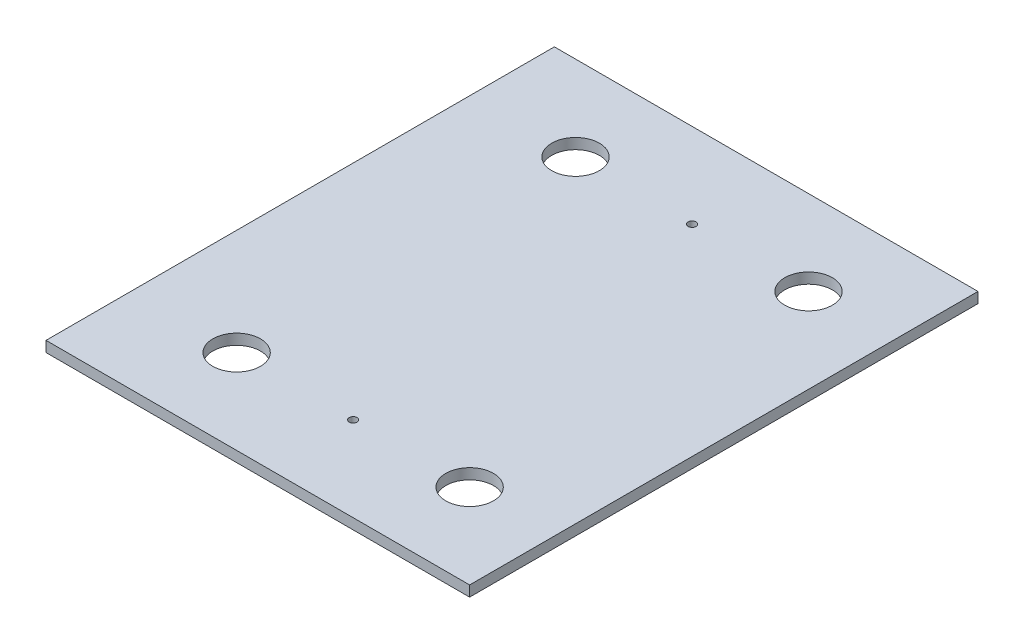
ISO-10303-21;
HEADER;
FILE_DESCRIPTION(('STEP AP214'),'2;1');
FILE_NAME('part.step','',(''),(''),'','','');
FILE_SCHEMA(('AUTOMOTIVE_DESIGN { 1 0 10303 214 1 1 1 1 }'));
ENDSEC;
DATA;
#1=APPLICATION_CONTEXT('core data for automotive mechanical design processes');
#2=APPLICATION_PROTOCOL_DEFINITION('international standard','automotive_design',2000,#1);
#3=PRODUCT_CONTEXT('',#1,'mechanical');
#4=PRODUCT('Part','Part','',(#3));
#5=PRODUCT_RELATED_PRODUCT_CATEGORY('part','',(#4));
#6=PRODUCT_DEFINITION_FORMATION('','',#4);
#7=PRODUCT_DEFINITION_CONTEXT('part definition',#1,'design');
#8=PRODUCT_DEFINITION('design','',#6,#7);
#9=PRODUCT_DEFINITION_SHAPE('','',#8);
#10=(LENGTH_UNIT() NAMED_UNIT(*) SI_UNIT(.MILLI.,.METRE.));
#11=(NAMED_UNIT(*) PLANE_ANGLE_UNIT() SI_UNIT($,.RADIAN.));
#12=(NAMED_UNIT(*) SI_UNIT($,.STERADIAN.) SOLID_ANGLE_UNIT());
#13=UNCERTAINTY_MEASURE_WITH_UNIT(LENGTH_MEASURE(1.E-05),#10,'distance_accuracy_value','');
#14=(GEOMETRIC_REPRESENTATION_CONTEXT(3) GLOBAL_UNCERTAINTY_ASSIGNED_CONTEXT((#13)) GLOBAL_UNIT_ASSIGNED_CONTEXT((#10,
#11,#12)) REPRESENTATION_CONTEXT('',''));
#15=CARTESIAN_POINT('',(0.,0.,0.));
#16=DIRECTION('',(0.,0.,1.));
#17=DIRECTION('',(1.,0.,0.));
#18=AXIS2_PLACEMENT_3D('',#15,#16,#17);
#19=CARTESIAN_POINT('',(0.,6.35,0.));
#20=DIRECTION('',(0.,-1.,0.));
#21=DIRECTION('',(0.,0.,-1.));
#22=AXIS2_PLACEMENT_3D('',#19,#20,#21);
#23=PLANE('',#22);
#24=DIRECTION('',(0.,0.,1.));
#25=VECTOR('',#24,1.);
#26=CARTESIAN_POINT('',(0.,6.35,0.));
#27=LINE('',#26,#25);
#28=CARTESIAN_POINT('',(0.,6.35,-304.8));
#29=VERTEX_POINT('',#28);
#30=CARTESIAN_POINT('',(0.,6.35,0.));
#31=VERTEX_POINT('',#30);
#32=EDGE_CURVE('E98',#29,#31,#27,.T.);
#33=ORIENTED_EDGE('',*,*,#32,.T.);
#34=DIRECTION('',(1.,0.,0.));
#35=VECTOR('',#34,1.);
#36=CARTESIAN_POINT('',(0.,6.35,0.));
#37=LINE('',#36,#35);
#38=CARTESIAN_POINT('',(254.,6.35,0.));
#39=VERTEX_POINT('',#38);
#40=EDGE_CURVE('E93',#31,#39,#37,.T.);
#41=ORIENTED_EDGE('',*,*,#40,.T.);
#42=DIRECTION('',(0.,0.,-1.));
#43=VECTOR('',#42,1.);
#44=CARTESIAN_POINT('',(254.,6.35,0.));
#45=LINE('',#44,#43);
#46=CARTESIAN_POINT('',(254.,6.35,-304.8));
#47=VERTEX_POINT('',#46);
#48=EDGE_CURVE('E96',#39,#47,#45,.T.);
#49=ORIENTED_EDGE('',*,*,#48,.T.);
#50=DIRECTION('',(-1.,0.,0.));
#51=VECTOR('',#50,1.);
#52=CARTESIAN_POINT('',(0.,6.35,-304.8));
#53=LINE('',#52,#51);
#54=EDGE_CURVE('E63',#47,#29,#53,.T.);
#55=ORIENTED_EDGE('',*,*,#54,.T.);
#56=EDGE_LOOP('',(#33,#41,#49,#55));
#57=FACE_BOUND('',#56,.T.);
#58=CARTESIAN_POINT('',(63.5,6.35,-50.8));
#59=DIRECTION('',(0.,1.,0.));
#60=DIRECTION('',(0.,0.,1.));
#61=AXIS2_PLACEMENT_3D('',#58,#59,#60);
#62=CIRCLE('',#61,14.2875);
#63=CARTESIAN_POINT('',(63.5,6.35,-36.5125));
#64=VERTEX_POINT('',#63);
#65=EDGE_CURVE('E118',#64,#64,#62,.T.);
#66=ORIENTED_EDGE('',*,*,#65,.F.);
#67=EDGE_LOOP('',(#66));
#68=FACE_BOUND('',#67,.T.);
#69=CARTESIAN_POINT('',(203.2,6.35,-50.8));
#70=DIRECTION('',(0.,1.,0.));
#71=DIRECTION('',(0.,0.,1.));
#72=AXIS2_PLACEMENT_3D('',#69,#70,#71);
#73=CIRCLE('',#72,14.2874999999999);
#74=CARTESIAN_POINT('',(203.2,6.35,-36.5125000000001));
#75=VERTEX_POINT('',#74);
#76=EDGE_CURVE('E140',#75,#75,#73,.T.);
#77=ORIENTED_EDGE('',*,*,#76,.F.);
#78=EDGE_LOOP('',(#77));
#79=FACE_BOUND('',#78,.T.);
#80=CARTESIAN_POINT('',(63.5,6.35,-254.));
#81=DIRECTION('',(0.,1.,0.));
#82=DIRECTION('',(0.,0.,1.));
#83=AXIS2_PLACEMENT_3D('',#80,#81,#82);
#84=CIRCLE('',#83,14.2875000000001);
#85=CARTESIAN_POINT('',(63.5,6.35,-239.7125));
#86=VERTEX_POINT('',#85);
#87=EDGE_CURVE('E148',#86,#86,#84,.T.);
#88=ORIENTED_EDGE('',*,*,#87,.F.);
#89=EDGE_LOOP('',(#88));
#90=FACE_BOUND('',#89,.T.);
#91=CARTESIAN_POINT('',(203.2,6.35,-254.));
#92=DIRECTION('',(0.,1.,0.));
#93=DIRECTION('',(0.,0.,1.));
#94=AXIS2_PLACEMENT_3D('',#91,#92,#93);
#95=CIRCLE('',#94,14.2874999999999);
#96=CARTESIAN_POINT('',(203.2,6.35,-239.7125));
#97=VERTEX_POINT('',#96);
#98=EDGE_CURVE('E156',#97,#97,#95,.T.);
#99=ORIENTED_EDGE('',*,*,#98,.F.);
#100=EDGE_LOOP('',(#99));
#101=FACE_BOUND('',#100,.T.);
#102=CARTESIAN_POINT('',(133.35,6.35,-50.8));
#103=DIRECTION('',(0.,1.,0.));
#104=DIRECTION('',(0.,0.,1.));
#105=AXIS2_PLACEMENT_3D('',#102,#103,#104);
#106=CIRCLE('',#105,2.38125);
#107=CARTESIAN_POINT('',(133.35,6.35,-48.41875));
#108=VERTEX_POINT('',#107);
#109=EDGE_CURVE('E164',#108,#108,#106,.T.);
#110=ORIENTED_EDGE('',*,*,#109,.F.);
#111=EDGE_LOOP('',(#110));
#112=FACE_BOUND('',#111,.T.);
#113=CARTESIAN_POINT('',(133.35,6.35,-254.));
#114=DIRECTION('',(0.,1.,0.));
#115=DIRECTION('',(0.,0.,1.));
#116=AXIS2_PLACEMENT_3D('',#113,#114,#115);
#117=CIRCLE('',#116,2.38125000000001);
#118=CARTESIAN_POINT('',(133.35,6.35,-251.61875));
#119=VERTEX_POINT('',#118);
#120=EDGE_CURVE('E172',#119,#119,#117,.T.);
#121=ORIENTED_EDGE('',*,*,#120,.F.);
#122=EDGE_LOOP('',(#121));
#123=FACE_BOUND('',#122,.T.);
#124=ADVANCED_FACE('F45',(#57,#68,#79,#90,#101,#112,#123),#23,.F.);
#125=CARTESIAN_POINT('',(0.,0.,0.));
#126=DIRECTION('',(0.,-1.,0.));
#127=DIRECTION('',(0.,0.,-1.));
#128=AXIS2_PLACEMENT_3D('',#125,#126,#127);
#129=PLANE('',#128);
#130=CARTESIAN_POINT('',(133.35,0.,-50.8));
#131=DIRECTION('',(0.,1.,0.));
#132=DIRECTION('',(0.,0.,1.));
#133=AXIS2_PLACEMENT_3D('',#130,#131,#132);
#134=CIRCLE('',#133,2.38125);
#135=CARTESIAN_POINT('',(133.35,0.,-48.41875));
#136=VERTEX_POINT('',#135);
#137=EDGE_CURVE('E168',#136,#136,#134,.T.);
#138=ORIENTED_EDGE('',*,*,#137,.T.);
#139=EDGE_LOOP('',(#138));
#140=FACE_BOUND('',#139,.T.);
#141=CARTESIAN_POINT('',(63.5,0.,-254.));
#142=DIRECTION('',(0.,1.,0.));
#143=DIRECTION('',(0.,0.,1.));
#144=AXIS2_PLACEMENT_3D('',#141,#142,#143);
#145=CIRCLE('',#144,14.2875000000001);
#146=CARTESIAN_POINT('',(63.5,0.,-239.7125));
#147=VERTEX_POINT('',#146);
#148=EDGE_CURVE('E152',#147,#147,#145,.T.);
#149=ORIENTED_EDGE('',*,*,#148,.T.);
#150=EDGE_LOOP('',(#149));
#151=FACE_BOUND('',#150,.T.);
#152=CARTESIAN_POINT('',(63.5,0.,-50.8));
#153=DIRECTION('',(0.,1.,0.));
#154=DIRECTION('',(0.,0.,1.));
#155=AXIS2_PLACEMENT_3D('',#152,#153,#154);
#156=CIRCLE('',#155,14.2875);
#157=CARTESIAN_POINT('',(63.5,0.,-36.5125));
#158=VERTEX_POINT('',#157);
#159=EDGE_CURVE('E136',#158,#158,#156,.T.);
#160=ORIENTED_EDGE('',*,*,#159,.T.);
#161=EDGE_LOOP('',(#160));
#162=FACE_BOUND('',#161,.T.);
#163=DIRECTION('',(0.,0.,1.));
#164=VECTOR('',#163,1.);
#165=CARTESIAN_POINT('',(0.,0.,0.));
#166=LINE('',#165,#164);
#167=CARTESIAN_POINT('',(0.,0.,-304.8));
#168=VERTEX_POINT('',#167);
#169=CARTESIAN_POINT('',(0.,0.,0.));
#170=VERTEX_POINT('',#169);
#171=EDGE_CURVE('E114',#168,#170,#166,.T.);
#172=ORIENTED_EDGE('',*,*,#171,.F.);
#173=DIRECTION('',(-1.,0.,0.));
#174=VECTOR('',#173,1.);
#175=CARTESIAN_POINT('',(0.,0.,-304.8));
#176=LINE('',#175,#174);
#177=CARTESIAN_POINT('',(254.,0.,-304.8));
#178=VERTEX_POINT('',#177);
#179=EDGE_CURVE('E86',#178,#168,#176,.T.);
#180=ORIENTED_EDGE('',*,*,#179,.F.);
#181=DIRECTION('',(0.,0.,-1.));
#182=VECTOR('',#181,1.);
#183=CARTESIAN_POINT('',(254.,0.,0.));
#184=LINE('',#183,#182);
#185=CARTESIAN_POINT('',(254.,0.,0.));
#186=VERTEX_POINT('',#185);
#187=EDGE_CURVE('E80',#186,#178,#184,.T.);
#188=ORIENTED_EDGE('',*,*,#187,.F.);
#189=DIRECTION('',(1.,0.,0.));
#190=VECTOR('',#189,1.);
#191=CARTESIAN_POINT('',(0.,0.,0.));
#192=LINE('',#191,#190);
#193=EDGE_CURVE('E103',#170,#186,#192,.T.);
#194=ORIENTED_EDGE('',*,*,#193,.F.);
#195=EDGE_LOOP('',(#172,#180,#188,#194));
#196=FACE_BOUND('',#195,.T.);
#197=CARTESIAN_POINT('',(203.2,0.,-50.8));
#198=DIRECTION('',(0.,1.,0.));
#199=DIRECTION('',(0.,0.,1.));
#200=AXIS2_PLACEMENT_3D('',#197,#198,#199);
#201=CIRCLE('',#200,14.2874999999999);
#202=CARTESIAN_POINT('',(203.2,0.,-36.5125000000001));
#203=VERTEX_POINT('',#202);
#204=EDGE_CURVE('E144',#203,#203,#201,.T.);
#205=ORIENTED_EDGE('',*,*,#204,.T.);
#206=EDGE_LOOP('',(#205));
#207=FACE_BOUND('',#206,.T.);
#208=CARTESIAN_POINT('',(203.2,0.,-254.));
#209=DIRECTION('',(0.,1.,0.));
#210=DIRECTION('',(0.,0.,1.));
#211=AXIS2_PLACEMENT_3D('',#208,#209,#210);
#212=CIRCLE('',#211,14.2874999999999);
#213=CARTESIAN_POINT('',(203.2,0.,-239.7125));
#214=VERTEX_POINT('',#213);
#215=EDGE_CURVE('E160',#214,#214,#212,.T.);
#216=ORIENTED_EDGE('',*,*,#215,.T.);
#217=EDGE_LOOP('',(#216));
#218=FACE_BOUND('',#217,.T.);
#219=CARTESIAN_POINT('',(133.35,0.,-254.));
#220=DIRECTION('',(0.,1.,0.));
#221=DIRECTION('',(0.,0.,1.));
#222=AXIS2_PLACEMENT_3D('',#219,#220,#221);
#223=CIRCLE('',#222,2.38125000000001);
#224=CARTESIAN_POINT('',(133.35,0.,-251.61875));
#225=VERTEX_POINT('',#224);
#226=EDGE_CURVE('E176',#225,#225,#223,.T.);
#227=ORIENTED_EDGE('',*,*,#226,.T.);
#228=EDGE_LOOP('',(#227));
#229=FACE_BOUND('',#228,.T.);
#230=ADVANCED_FACE('F131',(#140,#151,#162,#196,#207,#218,#229),#129,.T.);
#231=CARTESIAN_POINT('',(0.,6.35,0.));
#232=DIRECTION('',(1.,0.,0.));
#233=DIRECTION('',(0.,0.,-1.));
#234=AXIS2_PLACEMENT_3D('',#231,#232,#233);
#235=PLANE('',#234);
#236=ORIENTED_EDGE('',*,*,#171,.T.);
#237=DIRECTION('',(0.,-1.,0.));
#238=VECTOR('',#237,1.);
#239=CARTESIAN_POINT('',(0.,6.35,0.));
#240=LINE('',#239,#238);
#241=EDGE_CURVE('E11',#31,#170,#240,.T.);
#242=ORIENTED_EDGE('',*,*,#241,.F.);
#243=ORIENTED_EDGE('',*,*,#32,.F.);
#244=DIRECTION('',(0.,-1.,0.));
#245=VECTOR('',#244,1.);
#246=CARTESIAN_POINT('',(0.,6.35,-304.8));
#247=LINE('',#246,#245);
#248=EDGE_CURVE('E110',#29,#168,#247,.T.);
#249=ORIENTED_EDGE('',*,*,#248,.T.);
#250=EDGE_LOOP('',(#236,#242,#243,#249));
#251=FACE_BOUND('',#250,.T.);
#252=ADVANCED_FACE('F47',(#251),#235,.F.);
#253=CARTESIAN_POINT('',(0.,6.35,0.));
#254=DIRECTION('',(0.,0.,-1.));
#255=DIRECTION('',(-1.,0.,0.));
#256=AXIS2_PLACEMENT_3D('',#253,#254,#255);
#257=PLANE('',#256);
#258=ORIENTED_EDGE('',*,*,#193,.T.);
#259=DIRECTION('',(0.,-1.,0.));
#260=VECTOR('',#259,1.);
#261=CARTESIAN_POINT('',(254.,6.35,0.));
#262=LINE('',#261,#260);
#263=EDGE_CURVE('E55',#39,#186,#262,.T.);
#264=ORIENTED_EDGE('',*,*,#263,.F.);
#265=ORIENTED_EDGE('',*,*,#40,.F.);
#266=ORIENTED_EDGE('',*,*,#241,.T.);
#267=EDGE_LOOP('',(#258,#264,#265,#266));
#268=FACE_BOUND('',#267,.T.);
#269=ADVANCED_FACE('F102',(#268),#257,.F.);
#270=CARTESIAN_POINT('',(254.,6.35,0.));
#271=DIRECTION('',(-1.,0.,0.));
#272=DIRECTION('',(0.,0.,1.));
#273=AXIS2_PLACEMENT_3D('',#270,#271,#272);
#274=PLANE('',#273);
#275=ORIENTED_EDGE('',*,*,#187,.T.);
#276=DIRECTION('',(0.,-1.,0.));
#277=VECTOR('',#276,1.);
#278=CARTESIAN_POINT('',(254.,6.35,-304.8));
#279=LINE('',#278,#277);
#280=EDGE_CURVE('E105',#47,#178,#279,.T.);
#281=ORIENTED_EDGE('',*,*,#280,.F.);
#282=ORIENTED_EDGE('',*,*,#48,.F.);
#283=ORIENTED_EDGE('',*,*,#263,.T.);
#284=EDGE_LOOP('',(#275,#281,#282,#283));
#285=FACE_BOUND('',#284,.T.);
#286=ADVANCED_FACE('F106',(#285),#274,.F.);
#287=CARTESIAN_POINT('',(0.,6.35,-304.8));
#288=DIRECTION('',(0.,0.,1.));
#289=DIRECTION('',(1.,0.,0.));
#290=AXIS2_PLACEMENT_3D('',#287,#288,#289);
#291=PLANE('',#290);
#292=ORIENTED_EDGE('',*,*,#179,.T.);
#293=ORIENTED_EDGE('',*,*,#248,.F.);
#294=ORIENTED_EDGE('',*,*,#54,.F.);
#295=ORIENTED_EDGE('',*,*,#280,.T.);
#296=EDGE_LOOP('',(#292,#293,#294,#295));
#297=FACE_BOUND('',#296,.T.);
#298=ADVANCED_FACE('F128',(#297),#291,.F.);
#299=CARTESIAN_POINT('',(63.5,6.35,-50.8));
#300=DIRECTION('',(0.,-1.,0.));
#301=DIRECTION('',(0.,0.,-1.));
#302=AXIS2_PLACEMENT_3D('',#299,#300,#301);
#303=CYLINDRICAL_SURFACE('',#302,14.2875);
#304=ORIENTED_EDGE('',*,*,#65,.T.);
#305=EDGE_LOOP('',(#304));
#306=FACE_BOUND('',#305,.T.);
#307=ORIENTED_EDGE('',*,*,#159,.F.);
#308=EDGE_LOOP('',(#307));
#309=FACE_BOUND('',#308,.T.);
#310=ADVANCED_FACE('F195',(#306,#309),#303,.F.);
#311=CARTESIAN_POINT('',(203.2,6.35,-50.8));
#312=DIRECTION('',(0.,-1.,0.));
#313=DIRECTION('',(0.,0.,-1.));
#314=AXIS2_PLACEMENT_3D('',#311,#312,#313);
#315=CYLINDRICAL_SURFACE('',#314,14.2874999999999);
#316=ORIENTED_EDGE('',*,*,#76,.T.);
#317=EDGE_LOOP('',(#316));
#318=FACE_BOUND('',#317,.T.);
#319=ORIENTED_EDGE('',*,*,#204,.F.);
#320=EDGE_LOOP('',(#319));
#321=FACE_BOUND('',#320,.T.);
#322=ADVANCED_FACE('F240',(#318,#321),#315,.F.);
#323=CARTESIAN_POINT('',(63.5,6.35,-254.));
#324=DIRECTION('',(0.,-1.,0.));
#325=DIRECTION('',(0.,0.,-1.));
#326=AXIS2_PLACEMENT_3D('',#323,#324,#325);
#327=CYLINDRICAL_SURFACE('',#326,14.2875000000001);
#328=ORIENTED_EDGE('',*,*,#87,.T.);
#329=EDGE_LOOP('',(#328));
#330=FACE_BOUND('',#329,.T.);
#331=ORIENTED_EDGE('',*,*,#148,.F.);
#332=EDGE_LOOP('',(#331));
#333=FACE_BOUND('',#332,.T.);
#334=ADVANCED_FACE('F248',(#330,#333),#327,.F.);
#335=CARTESIAN_POINT('',(203.2,6.35,-254.));
#336=DIRECTION('',(0.,-1.,0.));
#337=DIRECTION('',(0.,0.,-1.));
#338=AXIS2_PLACEMENT_3D('',#335,#336,#337);
#339=CYLINDRICAL_SURFACE('',#338,14.2874999999999);
#340=ORIENTED_EDGE('',*,*,#98,.T.);
#341=EDGE_LOOP('',(#340));
#342=FACE_BOUND('',#341,.T.);
#343=ORIENTED_EDGE('',*,*,#215,.F.);
#344=EDGE_LOOP('',(#343));
#345=FACE_BOUND('',#344,.T.);
#346=ADVANCED_FACE('F256',(#342,#345),#339,.F.);
#347=CARTESIAN_POINT('',(133.35,6.35,-50.8));
#348=DIRECTION('',(0.,-1.,0.));
#349=DIRECTION('',(0.,0.,-1.));
#350=AXIS2_PLACEMENT_3D('',#347,#348,#349);
#351=CYLINDRICAL_SURFACE('',#350,2.38125);
#352=ORIENTED_EDGE('',*,*,#109,.T.);
#353=EDGE_LOOP('',(#352));
#354=FACE_BOUND('',#353,.T.);
#355=ORIENTED_EDGE('',*,*,#137,.F.);
#356=EDGE_LOOP('',(#355));
#357=FACE_BOUND('',#356,.T.);
#358=ADVANCED_FACE('F265',(#354,#357),#351,.F.);
#359=CARTESIAN_POINT('',(133.35,6.35,-254.));
#360=DIRECTION('',(0.,-1.,0.));
#361=DIRECTION('',(0.,0.,-1.));
#362=AXIS2_PLACEMENT_3D('',#359,#360,#361);
#363=CYLINDRICAL_SURFACE('',#362,2.38125000000001);
#364=ORIENTED_EDGE('',*,*,#120,.T.);
#365=EDGE_LOOP('',(#364));
#366=FACE_BOUND('',#365,.T.);
#367=ORIENTED_EDGE('',*,*,#226,.F.);
#368=EDGE_LOOP('',(#367));
#369=FACE_BOUND('',#368,.T.);
#370=ADVANCED_FACE('F184',(#366,#369),#363,.F.);
#371=CLOSED_SHELL('',(#124,#230,#252,#269,#286,#298,#310,#322,#334,#346,#358,#370));
#372=MANIFOLD_SOLID_BREP('B2',#371);
#373=ADVANCED_BREP_SHAPE_REPRESENTATION('',(#18,#372),#14);
#374=SHAPE_DEFINITION_REPRESENTATION(#9,#373);
ENDSEC;
END-ISO-10303-21;
